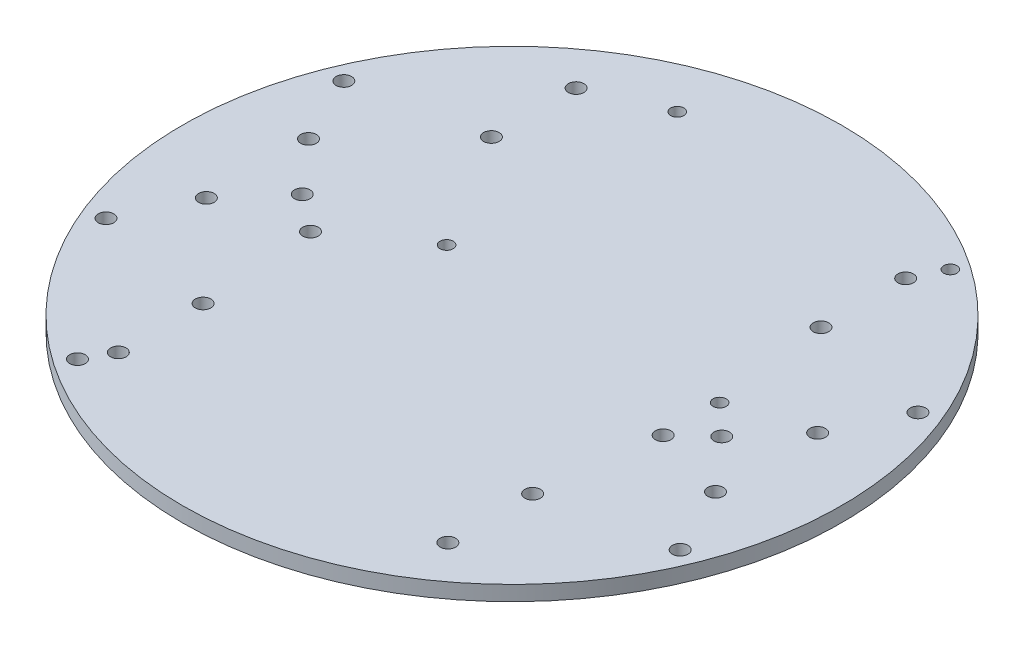
ISO-10303-21;
HEADER;
FILE_DESCRIPTION(('STEP AP214'),'2;1');
FILE_NAME('part.step','',(''),(''),'','','');
FILE_SCHEMA(('AUTOMOTIVE_DESIGN { 1 0 10303 214 1 1 1 1 }'));
ENDSEC;
DATA;
#1=APPLICATION_CONTEXT('core data for automotive mechanical design processes');
#2=APPLICATION_PROTOCOL_DEFINITION('international standard','automotive_design',2000,#1);
#3=PRODUCT_CONTEXT('',#1,'mechanical');
#4=PRODUCT('Part','Part','',(#3));
#5=PRODUCT_RELATED_PRODUCT_CATEGORY('part','',(#4));
#6=PRODUCT_DEFINITION_FORMATION('','',#4);
#7=PRODUCT_DEFINITION_CONTEXT('part definition',#1,'design');
#8=PRODUCT_DEFINITION('design','',#6,#7);
#9=PRODUCT_DEFINITION_SHAPE('','',#8);
#10=(LENGTH_UNIT() NAMED_UNIT(*) SI_UNIT(.MILLI.,.METRE.));
#11=(NAMED_UNIT(*) PLANE_ANGLE_UNIT() SI_UNIT($,.RADIAN.));
#12=(NAMED_UNIT(*) SI_UNIT($,.STERADIAN.) SOLID_ANGLE_UNIT());
#13=UNCERTAINTY_MEASURE_WITH_UNIT(LENGTH_MEASURE(1.E-05),#10,'distance_accuracy_value','');
#14=(GEOMETRIC_REPRESENTATION_CONTEXT(3) GLOBAL_UNCERTAINTY_ASSIGNED_CONTEXT((#13)) GLOBAL_UNIT_ASSIGNED_CONTEXT((#10,
#11,#12)) REPRESENTATION_CONTEXT('',''));
#15=CARTESIAN_POINT('',(0.,0.,0.));
#16=DIRECTION('',(0.,0.,1.));
#17=DIRECTION('',(1.,0.,0.));
#18=AXIS2_PLACEMENT_3D('',#15,#16,#17);
#19=CARTESIAN_POINT('',(0.,3.175,0.));
#20=DIRECTION('',(0.,1.,0.));
#21=DIRECTION('',(0.,0.,1.));
#22=AXIS2_PLACEMENT_3D('',#19,#20,#21);
#23=PLANE('',#22);
#24=CARTESIAN_POINT('',(-38.1,3.175,54.2));
#25=DIRECTION('',(0.,1.,0.));
#26=DIRECTION('',(0.,0.,1.));
#27=AXIS2_PLACEMENT_3D('',#24,#25,#26);
#28=CIRCLE('',#27,1.65);
#29=CARTESIAN_POINT('',(-38.1,3.175,55.85));
#30=VERTEX_POINT('',#29);
#31=EDGE_CURVE('E172',#30,#30,#28,.T.);
#32=ORIENTED_EDGE('',*,*,#31,.F.);
#33=EDGE_LOOP('',(#32));
#34=FACE_BOUND('',#33,.T.);
#35=CARTESIAN_POINT('',(-19.9,3.175,-6.));
#36=DIRECTION('',(0.,1.,0.));
#37=DIRECTION('',(0.,0.,1.));
#38=AXIS2_PLACEMENT_3D('',#35,#36,#37);
#39=CIRCLE('',#38,1.4);
#40=CARTESIAN_POINT('',(-19.9,3.175,-4.6));
#41=VERTEX_POINT('',#40);
#42=EDGE_CURVE('E161',#41,#41,#39,.T.);
#43=ORIENTED_EDGE('',*,*,#42,.F.);
#44=EDGE_LOOP('',(#43));
#45=FACE_BOUND('',#44,.T.);
#46=CARTESIAN_POINT('',(-19.9,3.175,-55.));
#47=DIRECTION('',(0.,1.,0.));
#48=DIRECTION('',(0.,0.,1.));
#49=AXIS2_PLACEMENT_3D('',#46,#47,#48);
#50=CIRCLE('',#49,1.4);
#51=CARTESIAN_POINT('',(-19.9,3.175,-53.6));
#52=VERTEX_POINT('',#51);
#53=EDGE_CURVE('E160',#52,#52,#50,.T.);
#54=ORIENTED_EDGE('',*,*,#53,.F.);
#55=EDGE_LOOP('',(#54));
#56=FACE_BOUND('',#55,.T.);
#57=CARTESIAN_POINT('',(38.1,3.175,-6.));
#58=DIRECTION('',(0.,1.,0.));
#59=DIRECTION('',(0.,0.,1.));
#60=AXIS2_PLACEMENT_3D('',#57,#58,#59);
#61=CIRCLE('',#60,1.4);
#62=CARTESIAN_POINT('',(38.1,3.175,-4.6));
#63=VERTEX_POINT('',#62);
#64=EDGE_CURVE('E154',#63,#63,#61,.T.);
#65=ORIENTED_EDGE('',*,*,#64,.F.);
#66=EDGE_LOOP('',(#65));
#67=FACE_BOUND('',#66,.T.);
#68=CARTESIAN_POINT('',(-36.8,3.175,6.));
#69=DIRECTION('',(0.,1.,0.));
#70=DIRECTION('',(0.,0.,1.));
#71=AXIS2_PLACEMENT_3D('',#68,#69,#70);
#72=CIRCLE('',#71,1.65);
#73=CARTESIAN_POINT('',(-36.8,3.175,7.65));
#74=VERTEX_POINT('',#73);
#75=EDGE_CURVE('E173',#74,#74,#72,.T.);
#76=ORIENTED_EDGE('',*,*,#75,.F.);
#77=EDGE_LOOP('',(#76));
#78=FACE_BOUND('',#77,.T.);
#79=CARTESIAN_POINT('',(38.1,3.175,6.));
#80=DIRECTION('',(0.,1.,0.));
#81=DIRECTION('',(0.,0.,1.));
#82=AXIS2_PLACEMENT_3D('',#79,#80,#81);
#83=CIRCLE('',#82,1.65);
#84=CARTESIAN_POINT('',(38.1,3.175,7.65));
#85=VERTEX_POINT('',#84);
#86=EDGE_CURVE('E184',#85,#85,#83,.T.);
#87=ORIENTED_EDGE('',*,*,#86,.F.);
#88=EDGE_LOOP('',(#87));
#89=FACE_BOUND('',#88,.T.);
#90=CARTESIAN_POINT('',(38.1,3.175,-55.));
#91=DIRECTION('',(0.,1.,0.));
#92=DIRECTION('',(0.,0.,1.));
#93=AXIS2_PLACEMENT_3D('',#90,#91,#92);
#94=CIRCLE('',#93,1.4);
#95=CARTESIAN_POINT('',(38.1,3.175,-53.6));
#96=VERTEX_POINT('',#95);
#97=EDGE_CURVE('E137',#96,#96,#94,.T.);
#98=ORIENTED_EDGE('',*,*,#97,.F.);
#99=EDGE_LOOP('',(#98));
#100=FACE_BOUND('',#99,.T.);
#101=CARTESIAN_POINT('',(-60.9760491457449,3.175,25.257106536096));
#102=DIRECTION('',(0.,1.,0.));
#103=DIRECTION('',(0.,0.,1.));
#104=AXIS2_PLACEMENT_3D('',#101,#102,#103);
#105=CIRCLE('',#104,1.65);
#106=CARTESIAN_POINT('',(-60.9760491457449,3.175,26.907106536096));
#107=VERTEX_POINT('',#106);
#108=EDGE_CURVE('E89',#107,#107,#105,.T.);
#109=ORIENTED_EDGE('',*,*,#108,.F.);
#110=EDGE_LOOP('',(#109));
#111=FACE_BOUND('',#110,.T.);
#112=CARTESIAN_POINT('',(35.,3.175,48.6217782649107));
#113=DIRECTION('',(0.,1.,0.));
#114=DIRECTION('',(0.,0.,-1.));
#115=AXIS2_PLACEMENT_3D('',#112,#113,#114);
#116=CIRCLE('',#115,1.65);
#117=CARTESIAN_POINT('',(35.,3.175,46.9717782649107));
#118=VERTEX_POINT('',#117);
#119=EDGE_CURVE('E112',#118,#118,#116,.T.);
#120=ORIENTED_EDGE('',*,*,#119,.F.);
#121=EDGE_LOOP('',(#120));
#122=FACE_BOUND('',#121,.T.);
#123=CARTESIAN_POINT('',(-35.,3.175,48.6217782649107));
#124=DIRECTION('',(0.,1.,0.));
#125=DIRECTION('',(0.,0.,1.));
#126=AXIS2_PLACEMENT_3D('',#123,#124,#125);
#127=CIRCLE('',#126,1.65);
#128=CARTESIAN_POINT('',(-35.,3.175,50.2717782649107));
#129=VERTEX_POINT('',#128);
#130=EDGE_CURVE('E113',#129,#129,#127,.T.);
#131=ORIENTED_EDGE('',*,*,#130,.F.);
#132=EDGE_LOOP('',(#131));
#133=FACE_BOUND('',#132,.T.);
#134=CARTESIAN_POINT('',(-60.9760491457449,3.175,-25.257106536096));
#135=DIRECTION('',(0.,1.,0.));
#136=DIRECTION('',(0.,0.,-1.));
#137=AXIS2_PLACEMENT_3D('',#134,#135,#136);
#138=CIRCLE('',#137,1.65);
#139=CARTESIAN_POINT('',(-60.9760491457449,3.175,-26.907106536096));
#140=VERTEX_POINT('',#139);
#141=EDGE_CURVE('E124',#140,#140,#138,.T.);
#142=ORIENTED_EDGE('',*,*,#141,.F.);
#143=EDGE_LOOP('',(#142));
#144=FACE_BOUND('',#143,.T.);
#145=CARTESIAN_POINT('',(35.,3.175,30.6217782649107));
#146=DIRECTION('',(0.,1.,0.));
#147=DIRECTION('',(0.,0.,-1.));
#148=AXIS2_PLACEMENT_3D('',#145,#146,#147);
#149=CIRCLE('',#148,1.65);
#150=CARTESIAN_POINT('',(35.,3.175,28.9717782649107));
#151=VERTEX_POINT('',#150);
#152=EDGE_CURVE('E88',#151,#151,#149,.T.);
#153=ORIENTED_EDGE('',*,*,#152,.F.);
#154=EDGE_LOOP('',(#153));
#155=FACE_BOUND('',#154,.T.);
#156=CARTESIAN_POINT('',(60.9760491457449,3.175,25.257106536096));
#157=DIRECTION('',(0.,1.,0.));
#158=DIRECTION('',(0.,0.,-1.));
#159=AXIS2_PLACEMENT_3D('',#156,#157,#158);
#160=CIRCLE('',#159,1.65);
#161=CARTESIAN_POINT('',(60.9760491457449,3.175,23.607106536096));
#162=VERTEX_POINT('',#161);
#163=EDGE_CURVE('E95',#162,#162,#160,.T.);
#164=ORIENTED_EDGE('',*,*,#163,.F.);
#165=EDGE_LOOP('',(#164));
#166=FACE_BOUND('',#165,.T.);
#167=CARTESIAN_POINT('',(35.,3.175,-30.6217782649107));
#168=DIRECTION('',(0.,1.,0.));
#169=DIRECTION('',(0.,0.,1.));
#170=AXIS2_PLACEMENT_3D('',#167,#168,#169);
#171=CIRCLE('',#170,1.65);
#172=CARTESIAN_POINT('',(35.,3.175,-28.9717782649107));
#173=VERTEX_POINT('',#172);
#174=EDGE_CURVE('E101',#173,#173,#171,.T.);
#175=ORIENTED_EDGE('',*,*,#174,.F.);
#176=EDGE_LOOP('',(#175));
#177=FACE_BOUND('',#176,.T.);
#178=CARTESIAN_POINT('',(60.9760491457449,3.175,-25.257106536096));
#179=DIRECTION('',(0.,1.,0.));
#180=DIRECTION('',(0.,0.,1.));
#181=AXIS2_PLACEMENT_3D('',#178,#179,#180);
#182=CIRCLE('',#181,1.65);
#183=CARTESIAN_POINT('',(60.9760491457449,3.175,-23.607106536096));
#184=VERTEX_POINT('',#183);
#185=EDGE_CURVE('E82',#184,#184,#182,.T.);
#186=ORIENTED_EDGE('',*,*,#185,.F.);
#187=EDGE_LOOP('',(#186));
#188=FACE_BOUND('',#187,.T.);
#189=CARTESIAN_POINT('',(-35.,3.175,30.6217782649107));
#190=DIRECTION('',(0.,1.,0.));
#191=DIRECTION('',(0.,0.,1.));
#192=AXIS2_PLACEMENT_3D('',#189,#190,#191);
#193=CIRCLE('',#192,1.65);
#194=CARTESIAN_POINT('',(-35.,3.175,32.2717782649107));
#195=VERTEX_POINT('',#194);
#196=EDGE_CURVE('E125',#195,#195,#193,.T.);
#197=ORIENTED_EDGE('',*,*,#196,.F.);
#198=EDGE_LOOP('',(#197));
#199=FACE_BOUND('',#198,.T.);
#200=CARTESIAN_POINT('',(-35.,3.175,-30.6217782649107));
#201=DIRECTION('',(0.,1.,0.));
#202=DIRECTION('',(0.,0.,-1.));
#203=AXIS2_PLACEMENT_3D('',#200,#201,#202);
#204=CIRCLE('',#203,1.65);
#205=CARTESIAN_POINT('',(-35.,3.175,-32.2717782649107));
#206=VERTEX_POINT('',#205);
#207=EDGE_CURVE('E143',#206,#206,#204,.T.);
#208=ORIENTED_EDGE('',*,*,#207,.F.);
#209=EDGE_LOOP('',(#208));
#210=FACE_BOUND('',#209,.T.);
#211=CARTESIAN_POINT('',(-35.,3.175,-48.6217782649107));
#212=DIRECTION('',(0.,1.,0.));
#213=DIRECTION('',(0.,0.,-1.));
#214=AXIS2_PLACEMENT_3D('',#211,#212,#213);
#215=CIRCLE('',#214,1.65);
#216=CARTESIAN_POINT('',(-35.,3.175,-50.2717782649107));
#217=VERTEX_POINT('',#216);
#218=EDGE_CURVE('E136',#217,#217,#215,.T.);
#219=ORIENTED_EDGE('',*,*,#218,.F.);
#220=EDGE_LOOP('',(#219));
#221=FACE_BOUND('',#220,.T.);
#222=CARTESIAN_POINT('',(35.,3.175,-48.6217782649107));
#223=DIRECTION('',(0.,1.,0.));
#224=DIRECTION('',(0.,0.,1.));
#225=AXIS2_PLACEMENT_3D('',#222,#223,#224);
#226=CIRCLE('',#225,1.65);
#227=CARTESIAN_POINT('',(35.,3.175,-46.9717782649107));
#228=VERTEX_POINT('',#227);
#229=EDGE_CURVE('E76',#228,#228,#226,.T.);
#230=ORIENTED_EDGE('',*,*,#229,.F.);
#231=EDGE_LOOP('',(#230));
#232=FACE_BOUND('',#231,.T.);
#233=CARTESIAN_POINT('',(-54.075,3.175,-10.85));
#234=DIRECTION('',(0.,1.,0.));
#235=DIRECTION('',(0.,0.,-1.));
#236=AXIS2_PLACEMENT_3D('',#233,#234,#235);
#237=CIRCLE('',#236,1.651);
#238=CARTESIAN_POINT('',(-54.075,3.175,-12.501));
#239=VERTEX_POINT('',#238);
#240=EDGE_CURVE('E64',#239,#239,#237,.T.);
#241=ORIENTED_EDGE('',*,*,#240,.F.);
#242=EDGE_LOOP('',(#241));
#243=FACE_BOUND('',#242,.T.);
#244=CARTESIAN_POINT('',(54.075,3.175,10.85));
#245=DIRECTION('',(0.,1.,0.));
#246=DIRECTION('',(0.,0.,1.));
#247=AXIS2_PLACEMENT_3D('',#244,#245,#246);
#248=CIRCLE('',#247,1.651);
#249=CARTESIAN_POINT('',(54.075,3.175,12.501));
#250=VERTEX_POINT('',#249);
#251=EDGE_CURVE('E52',#250,#250,#248,.T.);
#252=ORIENTED_EDGE('',*,*,#251,.F.);
#253=EDGE_LOOP('',(#252));
#254=FACE_BOUND('',#253,.T.);
#255=CARTESIAN_POINT('',(44.55,3.175,0.));
#256=DIRECTION('',(0.,1.,0.));
#257=DIRECTION('',(0.,0.,1.));
#258=AXIS2_PLACEMENT_3D('',#255,#256,#257);
#259=CIRCLE('',#258,1.651);
#260=CARTESIAN_POINT('',(44.55,3.175,1.65100000000002));
#261=VERTEX_POINT('',#260);
#262=EDGE_CURVE('E41',#261,#261,#259,.T.);
#263=ORIENTED_EDGE('',*,*,#262,.F.);
#264=EDGE_LOOP('',(#263));
#265=FACE_BOUND('',#264,.T.);
#266=CARTESIAN_POINT('',(0.,3.175,0.));
#267=DIRECTION('',(0.,1.,0.));
#268=DIRECTION('',(0.,0.,1.));
#269=AXIS2_PLACEMENT_3D('',#266,#267,#268);
#270=CIRCLE('',#269,70.);
#271=CARTESIAN_POINT('',(0.,3.175,70.));
#272=VERTEX_POINT('',#271);
#273=EDGE_CURVE('E10',#272,#272,#270,.T.);
#274=ORIENTED_EDGE('',*,*,#273,.T.);
#275=EDGE_LOOP('',(#274));
#276=FACE_BOUND('',#275,.T.);
#277=CARTESIAN_POINT('',(54.075,3.175,-10.85));
#278=DIRECTION('',(0.,1.,0.));
#279=DIRECTION('',(0.,0.,1.));
#280=AXIS2_PLACEMENT_3D('',#277,#278,#279);
#281=CIRCLE('',#280,1.651);
#282=CARTESIAN_POINT('',(54.075,3.175,-9.199));
#283=VERTEX_POINT('',#282);
#284=EDGE_CURVE('E46',#283,#283,#281,.T.);
#285=ORIENTED_EDGE('',*,*,#284,.F.);
#286=EDGE_LOOP('',(#285));
#287=FACE_BOUND('',#286,.T.);
#288=CARTESIAN_POINT('',(-54.075,3.175,10.85));
#289=DIRECTION('',(0.,1.,0.));
#290=DIRECTION('',(0.,0.,-1.));
#291=AXIS2_PLACEMENT_3D('',#288,#289,#290);
#292=CIRCLE('',#291,1.651);
#293=CARTESIAN_POINT('',(-54.075,3.175,9.19900000000002));
#294=VERTEX_POINT('',#293);
#295=EDGE_CURVE('E58',#294,#294,#292,.T.);
#296=ORIENTED_EDGE('',*,*,#295,.F.);
#297=EDGE_LOOP('',(#296));
#298=FACE_BOUND('',#297,.T.);
#299=CARTESIAN_POINT('',(-44.55,3.175,0.));
#300=DIRECTION('',(0.,1.,0.));
#301=DIRECTION('',(0.,0.,-1.));
#302=AXIS2_PLACEMENT_3D('',#299,#300,#301);
#303=CIRCLE('',#302,1.651);
#304=CARTESIAN_POINT('',(-44.55,3.175,-1.65099999999997));
#305=VERTEX_POINT('',#304);
#306=EDGE_CURVE('E70',#305,#305,#303,.T.);
#307=ORIENTED_EDGE('',*,*,#306,.F.);
#308=EDGE_LOOP('',(#307));
#309=FACE_BOUND('',#308,.T.);
#310=ADVANCED_FACE('F30',(#34,#45,#56,#67,#78,#89,#100,#111,#122,#133,#144,#155,#166,#177,#188,
#199,#210,#221,#232,#243,#254,#265,#276,#287,#298,#309),#23,.T.);
#311=CARTESIAN_POINT('',(0.,0.,0.));
#312=DIRECTION('',(0.,1.,0.));
#313=DIRECTION('',(0.,0.,1.));
#314=AXIS2_PLACEMENT_3D('',#311,#312,#313);
#315=PLANE('',#314);
#316=CARTESIAN_POINT('',(-38.1,0.,54.2));
#317=DIRECTION('',(0.,1.,0.));
#318=DIRECTION('',(0.,0.,1.));
#319=AXIS2_PLACEMENT_3D('',#316,#317,#318);
#320=CIRCLE('',#319,1.65);
#321=CARTESIAN_POINT('',(-38.1,0.,55.85));
#322=VERTEX_POINT('',#321);
#323=EDGE_CURVE('E169',#322,#322,#320,.T.);
#324=ORIENTED_EDGE('',*,*,#323,.T.);
#325=EDGE_LOOP('',(#324));
#326=FACE_BOUND('',#325,.T.);
#327=CARTESIAN_POINT('',(-19.9,0.,-6.));
#328=DIRECTION('',(0.,1.,0.));
#329=DIRECTION('',(0.,0.,1.));
#330=AXIS2_PLACEMENT_3D('',#327,#328,#329);
#331=CIRCLE('',#330,1.4);
#332=CARTESIAN_POINT('',(-19.9,0.,-4.6));
#333=VERTEX_POINT('',#332);
#334=EDGE_CURVE('E176',#333,#333,#331,.T.);
#335=ORIENTED_EDGE('',*,*,#334,.T.);
#336=EDGE_LOOP('',(#335));
#337=FACE_BOUND('',#336,.T.);
#338=CARTESIAN_POINT('',(-19.9,0.,-55.));
#339=DIRECTION('',(0.,1.,0.));
#340=DIRECTION('',(0.,0.,1.));
#341=AXIS2_PLACEMENT_3D('',#338,#339,#340);
#342=CIRCLE('',#341,1.4);
#343=CARTESIAN_POINT('',(-19.9,0.,-53.6));
#344=VERTEX_POINT('',#343);
#345=EDGE_CURVE('E157',#344,#344,#342,.T.);
#346=ORIENTED_EDGE('',*,*,#345,.T.);
#347=EDGE_LOOP('',(#346));
#348=FACE_BOUND('',#347,.T.);
#349=CARTESIAN_POINT('',(38.1,0.,-6.));
#350=DIRECTION('',(0.,1.,0.));
#351=DIRECTION('',(0.,0.,1.));
#352=AXIS2_PLACEMENT_3D('',#349,#350,#351);
#353=CIRCLE('',#352,1.4);
#354=CARTESIAN_POINT('',(38.1,0.,-4.6));
#355=VERTEX_POINT('',#354);
#356=EDGE_CURVE('E164',#355,#355,#353,.T.);
#357=ORIENTED_EDGE('',*,*,#356,.T.);
#358=EDGE_LOOP('',(#357));
#359=FACE_BOUND('',#358,.T.);
#360=CARTESIAN_POINT('',(-36.8,0.,6.));
#361=DIRECTION('',(0.,1.,0.));
#362=DIRECTION('',(0.,0.,1.));
#363=AXIS2_PLACEMENT_3D('',#360,#361,#362);
#364=CIRCLE('',#363,1.65);
#365=CARTESIAN_POINT('',(-36.8,0.,7.65));
#366=VERTEX_POINT('',#365);
#367=EDGE_CURVE('E187',#366,#366,#364,.T.);
#368=ORIENTED_EDGE('',*,*,#367,.T.);
#369=EDGE_LOOP('',(#368));
#370=FACE_BOUND('',#369,.T.);
#371=CARTESIAN_POINT('',(38.1,0.,6.));
#372=DIRECTION('',(0.,1.,0.));
#373=DIRECTION('',(0.,0.,1.));
#374=AXIS2_PLACEMENT_3D('',#371,#372,#373);
#375=CIRCLE('',#374,1.65);
#376=CARTESIAN_POINT('',(38.1,0.,7.65));
#377=VERTEX_POINT('',#376);
#378=EDGE_CURVE('E181',#377,#377,#375,.T.);
#379=ORIENTED_EDGE('',*,*,#378,.T.);
#380=EDGE_LOOP('',(#379));
#381=FACE_BOUND('',#380,.T.);
#382=CARTESIAN_POINT('',(38.1,0.,-55.));
#383=DIRECTION('',(0.,1.,0.));
#384=DIRECTION('',(0.,0.,1.));
#385=AXIS2_PLACEMENT_3D('',#382,#383,#384);
#386=CIRCLE('',#385,1.4);
#387=CARTESIAN_POINT('',(38.1,0.,-53.6));
#388=VERTEX_POINT('',#387);
#389=EDGE_CURVE('E151',#388,#388,#386,.T.);
#390=ORIENTED_EDGE('',*,*,#389,.T.);
#391=EDGE_LOOP('',(#390));
#392=FACE_BOUND('',#391,.T.);
#393=CARTESIAN_POINT('',(-60.9760491457449,0.,25.257106536096));
#394=DIRECTION('',(0.,1.,0.));
#395=DIRECTION('',(0.,0.,1.));
#396=AXIS2_PLACEMENT_3D('',#393,#394,#395);
#397=CIRCLE('',#396,1.65);
#398=CARTESIAN_POINT('',(-60.9760491457449,0.,26.907106536096));
#399=VERTEX_POINT('',#398);
#400=EDGE_CURVE('E116',#399,#399,#397,.T.);
#401=ORIENTED_EDGE('',*,*,#400,.T.);
#402=EDGE_LOOP('',(#401));
#403=FACE_BOUND('',#402,.T.);
#404=CARTESIAN_POINT('',(35.,0.,48.6217782649107));
#405=DIRECTION('',(0.,1.,0.));
#406=DIRECTION('',(0.,0.,-1.));
#407=AXIS2_PLACEMENT_3D('',#404,#405,#406);
#408=CIRCLE('',#407,1.65);
#409=CARTESIAN_POINT('',(35.,0.,46.9717782649107));
#410=VERTEX_POINT('',#409);
#411=EDGE_CURVE('E109',#410,#410,#408,.T.);
#412=ORIENTED_EDGE('',*,*,#411,.T.);
#413=EDGE_LOOP('',(#412));
#414=FACE_BOUND('',#413,.T.);
#415=CARTESIAN_POINT('',(-35.,0.,48.6217782649107));
#416=DIRECTION('',(0.,1.,0.));
#417=DIRECTION('',(0.,0.,1.));
#418=AXIS2_PLACEMENT_3D('',#415,#416,#417);
#419=CIRCLE('',#418,1.65);
#420=CARTESIAN_POINT('',(-35.,0.,50.2717782649107));
#421=VERTEX_POINT('',#420);
#422=EDGE_CURVE('E128',#421,#421,#419,.T.);
#423=ORIENTED_EDGE('',*,*,#422,.T.);
#424=EDGE_LOOP('',(#423));
#425=FACE_BOUND('',#424,.T.);
#426=CARTESIAN_POINT('',(-60.9760491457449,0.,-25.257106536096));
#427=DIRECTION('',(0.,1.,0.));
#428=DIRECTION('',(0.,0.,-1.));
#429=AXIS2_PLACEMENT_3D('',#426,#427,#428);
#430=CIRCLE('',#429,1.65);
#431=CARTESIAN_POINT('',(-60.9760491457449,0.,-26.907106536096));
#432=VERTEX_POINT('',#431);
#433=EDGE_CURVE('E121',#432,#432,#430,.T.);
#434=ORIENTED_EDGE('',*,*,#433,.T.);
#435=EDGE_LOOP('',(#434));
#436=FACE_BOUND('',#435,.T.);
#437=CARTESIAN_POINT('',(35.,0.,30.6217782649107));
#438=DIRECTION('',(0.,1.,0.));
#439=DIRECTION('',(0.,0.,-1.));
#440=AXIS2_PLACEMENT_3D('',#437,#438,#439);
#441=CIRCLE('',#440,1.65);
#442=CARTESIAN_POINT('',(35.,0.,28.9717782649107));
#443=VERTEX_POINT('',#442);
#444=EDGE_CURVE('E85',#443,#443,#441,.T.);
#445=ORIENTED_EDGE('',*,*,#444,.T.);
#446=EDGE_LOOP('',(#445));
#447=FACE_BOUND('',#446,.T.);
#448=CARTESIAN_POINT('',(60.9760491457449,0.,25.257106536096));
#449=DIRECTION('',(0.,1.,0.));
#450=DIRECTION('',(0.,0.,-1.));
#451=AXIS2_PLACEMENT_3D('',#448,#449,#450);
#452=CIRCLE('',#451,1.65);
#453=CARTESIAN_POINT('',(60.9760491457449,0.,23.607106536096));
#454=VERTEX_POINT('',#453);
#455=EDGE_CURVE('E92',#454,#454,#452,.T.);
#456=ORIENTED_EDGE('',*,*,#455,.T.);
#457=EDGE_LOOP('',(#456));
#458=FACE_BOUND('',#457,.T.);
#459=CARTESIAN_POINT('',(35.,0.,-30.6217782649107));
#460=DIRECTION('',(0.,1.,0.));
#461=DIRECTION('',(0.,0.,1.));
#462=AXIS2_PLACEMENT_3D('',#459,#460,#461);
#463=CIRCLE('',#462,1.65);
#464=CARTESIAN_POINT('',(35.,0.,-28.9717782649107));
#465=VERTEX_POINT('',#464);
#466=EDGE_CURVE('E98',#465,#465,#463,.T.);
#467=ORIENTED_EDGE('',*,*,#466,.T.);
#468=EDGE_LOOP('',(#467));
#469=FACE_BOUND('',#468,.T.);
#470=CARTESIAN_POINT('',(60.9760491457449,0.,-25.257106536096));
#471=DIRECTION('',(0.,1.,0.));
#472=DIRECTION('',(0.,0.,1.));
#473=AXIS2_PLACEMENT_3D('',#470,#471,#472);
#474=CIRCLE('',#473,1.65);
#475=CARTESIAN_POINT('',(60.9760491457449,0.,-23.607106536096));
#476=VERTEX_POINT('',#475);
#477=EDGE_CURVE('E104',#476,#476,#474,.T.);
#478=ORIENTED_EDGE('',*,*,#477,.T.);
#479=EDGE_LOOP('',(#478));
#480=FACE_BOUND('',#479,.T.);
#481=CARTESIAN_POINT('',(-35.,0.,30.6217782649107));
#482=DIRECTION('',(0.,1.,0.));
#483=DIRECTION('',(0.,0.,1.));
#484=AXIS2_PLACEMENT_3D('',#481,#482,#483);
#485=CIRCLE('',#484,1.65);
#486=CARTESIAN_POINT('',(-35.,0.,32.2717782649107));
#487=VERTEX_POINT('',#486);
#488=EDGE_CURVE('E146',#487,#487,#485,.T.);
#489=ORIENTED_EDGE('',*,*,#488,.T.);
#490=EDGE_LOOP('',(#489));
#491=FACE_BOUND('',#490,.T.);
#492=CARTESIAN_POINT('',(-35.,0.,-30.6217782649107));
#493=DIRECTION('',(0.,1.,0.));
#494=DIRECTION('',(0.,0.,-1.));
#495=AXIS2_PLACEMENT_3D('',#492,#493,#494);
#496=CIRCLE('',#495,1.65);
#497=CARTESIAN_POINT('',(-35.,0.,-32.2717782649107));
#498=VERTEX_POINT('',#497);
#499=EDGE_CURVE('E140',#498,#498,#496,.T.);
#500=ORIENTED_EDGE('',*,*,#499,.T.);
#501=EDGE_LOOP('',(#500));
#502=FACE_BOUND('',#501,.T.);
#503=CARTESIAN_POINT('',(-35.,0.,-48.6217782649107));
#504=DIRECTION('',(0.,1.,0.));
#505=DIRECTION('',(0.,0.,-1.));
#506=AXIS2_PLACEMENT_3D('',#503,#504,#505);
#507=CIRCLE('',#506,1.65);
#508=CARTESIAN_POINT('',(-35.,0.,-50.2717782649107));
#509=VERTEX_POINT('',#508);
#510=EDGE_CURVE('E133',#509,#509,#507,.T.);
#511=ORIENTED_EDGE('',*,*,#510,.T.);
#512=EDGE_LOOP('',(#511));
#513=FACE_BOUND('',#512,.T.);
#514=CARTESIAN_POINT('',(35.,0.,-48.6217782649107));
#515=DIRECTION('',(0.,1.,0.));
#516=DIRECTION('',(0.,0.,1.));
#517=AXIS2_PLACEMENT_3D('',#514,#515,#516);
#518=CIRCLE('',#517,1.65);
#519=CARTESIAN_POINT('',(35.,0.,-46.9717782649107));
#520=VERTEX_POINT('',#519);
#521=EDGE_CURVE('E79',#520,#520,#518,.T.);
#522=ORIENTED_EDGE('',*,*,#521,.T.);
#523=EDGE_LOOP('',(#522));
#524=FACE_BOUND('',#523,.T.);
#525=CARTESIAN_POINT('',(0.,0.,0.));
#526=DIRECTION('',(0.,1.,0.));
#527=DIRECTION('',(0.,0.,1.));
#528=AXIS2_PLACEMENT_3D('',#525,#526,#527);
#529=CIRCLE('',#528,70.);
#530=CARTESIAN_POINT('',(0.,0.,70.));
#531=VERTEX_POINT('',#530);
#532=EDGE_CURVE('E34',#531,#531,#529,.T.);
#533=ORIENTED_EDGE('',*,*,#532,.F.);
#534=EDGE_LOOP('',(#533));
#535=FACE_BOUND('',#534,.T.);
#536=CARTESIAN_POINT('',(44.55,0.,0.));
#537=DIRECTION('',(0.,1.,0.));
#538=DIRECTION('',(0.,0.,1.));
#539=AXIS2_PLACEMENT_3D('',#536,#537,#538);
#540=CIRCLE('',#539,1.651);
#541=CARTESIAN_POINT('',(44.55,0.,1.65100000000002));
#542=VERTEX_POINT('',#541);
#543=EDGE_CURVE('E43',#542,#542,#540,.T.);
#544=ORIENTED_EDGE('',*,*,#543,.T.);
#545=EDGE_LOOP('',(#544));
#546=FACE_BOUND('',#545,.T.);
#547=CARTESIAN_POINT('',(54.075,0.,-10.85));
#548=DIRECTION('',(0.,1.,0.));
#549=DIRECTION('',(0.,0.,1.));
#550=AXIS2_PLACEMENT_3D('',#547,#548,#549);
#551=CIRCLE('',#550,1.651);
#552=CARTESIAN_POINT('',(54.075,0.,-9.199));
#553=VERTEX_POINT('',#552);
#554=EDGE_CURVE('E49',#553,#553,#551,.T.);
#555=ORIENTED_EDGE('',*,*,#554,.T.);
#556=EDGE_LOOP('',(#555));
#557=FACE_BOUND('',#556,.T.);
#558=CARTESIAN_POINT('',(54.075,0.,10.85));
#559=DIRECTION('',(0.,1.,0.));
#560=DIRECTION('',(0.,0.,1.));
#561=AXIS2_PLACEMENT_3D('',#558,#559,#560);
#562=CIRCLE('',#561,1.651);
#563=CARTESIAN_POINT('',(54.075,0.,12.501));
#564=VERTEX_POINT('',#563);
#565=EDGE_CURVE('E55',#564,#564,#562,.T.);
#566=ORIENTED_EDGE('',*,*,#565,.T.);
#567=EDGE_LOOP('',(#566));
#568=FACE_BOUND('',#567,.T.);
#569=CARTESIAN_POINT('',(-54.075,0.,10.85));
#570=DIRECTION('',(0.,1.,0.));
#571=DIRECTION('',(0.,0.,-1.));
#572=AXIS2_PLACEMENT_3D('',#569,#570,#571);
#573=CIRCLE('',#572,1.651);
#574=CARTESIAN_POINT('',(-54.075,0.,9.19900000000002));
#575=VERTEX_POINT('',#574);
#576=EDGE_CURVE('E61',#575,#575,#573,.T.);
#577=ORIENTED_EDGE('',*,*,#576,.T.);
#578=EDGE_LOOP('',(#577));
#579=FACE_BOUND('',#578,.T.);
#580=CARTESIAN_POINT('',(-54.075,0.,-10.85));
#581=DIRECTION('',(0.,1.,0.));
#582=DIRECTION('',(0.,0.,-1.));
#583=AXIS2_PLACEMENT_3D('',#580,#581,#582);
#584=CIRCLE('',#583,1.651);
#585=CARTESIAN_POINT('',(-54.075,0.,-12.501));
#586=VERTEX_POINT('',#585);
#587=EDGE_CURVE('E67',#586,#586,#584,.T.);
#588=ORIENTED_EDGE('',*,*,#587,.T.);
#589=EDGE_LOOP('',(#588));
#590=FACE_BOUND('',#589,.T.);
#591=CARTESIAN_POINT('',(-44.55,0.,0.));
#592=DIRECTION('',(0.,1.,0.));
#593=DIRECTION('',(0.,0.,-1.));
#594=AXIS2_PLACEMENT_3D('',#591,#592,#593);
#595=CIRCLE('',#594,1.651);
#596=CARTESIAN_POINT('',(-44.55,0.,-1.65099999999997));
#597=VERTEX_POINT('',#596);
#598=EDGE_CURVE('E73',#597,#597,#595,.T.);
#599=ORIENTED_EDGE('',*,*,#598,.T.);
#600=EDGE_LOOP('',(#599));
#601=FACE_BOUND('',#600,.T.);
#602=ADVANCED_FACE('F198',(#326,#337,#348,#359,#370,#381,#392,#403,#414,#425,#436,#447,#458,
#469,#480,#491,#502,#513,#524,#535,#546,#557,#568,#579,#590,#601),#315,.F.);
#603=CARTESIAN_POINT('',(0.,3.175,0.));
#604=DIRECTION('',(0.,-1.,0.));
#605=DIRECTION('',(0.,0.,-1.));
#606=AXIS2_PLACEMENT_3D('',#603,#604,#605);
#607=CYLINDRICAL_SURFACE('',#606,70.);
#608=ORIENTED_EDGE('',*,*,#273,.F.);
#609=EDGE_LOOP('',(#608));
#610=FACE_BOUND('',#609,.T.);
#611=ORIENTED_EDGE('',*,*,#532,.T.);
#612=EDGE_LOOP('',(#611));
#613=FACE_BOUND('',#612,.T.);
#614=ADVANCED_FACE('F32',(#610,#613),#607,.T.);
#615=CARTESIAN_POINT('',(44.55,3.175,0.));
#616=DIRECTION('',(0.,-1.,0.));
#617=DIRECTION('',(0.,0.,-1.));
#618=AXIS2_PLACEMENT_3D('',#615,#616,#617);
#619=CYLINDRICAL_SURFACE('',#618,1.651);
#620=ORIENTED_EDGE('',*,*,#262,.T.);
#621=EDGE_LOOP('',(#620));
#622=FACE_BOUND('',#621,.T.);
#623=ORIENTED_EDGE('',*,*,#543,.F.);
#624=EDGE_LOOP('',(#623));
#625=FACE_BOUND('',#624,.T.);
#626=ADVANCED_FACE('F254',(#622,#625),#619,.F.);
#627=CARTESIAN_POINT('',(54.075,3.175,-10.85));
#628=DIRECTION('',(0.,-1.,0.));
#629=DIRECTION('',(0.,0.,-1.));
#630=AXIS2_PLACEMENT_3D('',#627,#628,#629);
#631=CYLINDRICAL_SURFACE('',#630,1.651);
#632=ORIENTED_EDGE('',*,*,#284,.T.);
#633=EDGE_LOOP('',(#632));
#634=FACE_BOUND('',#633,.T.);
#635=ORIENTED_EDGE('',*,*,#554,.F.);
#636=EDGE_LOOP('',(#635));
#637=FACE_BOUND('',#636,.T.);
#638=ADVANCED_FACE('F260',(#634,#637),#631,.F.);
#639=CARTESIAN_POINT('',(54.075,3.175,10.85));
#640=DIRECTION('',(0.,-1.,0.));
#641=DIRECTION('',(0.,0.,-1.));
#642=AXIS2_PLACEMENT_3D('',#639,#640,#641);
#643=CYLINDRICAL_SURFACE('',#642,1.651);
#644=ORIENTED_EDGE('',*,*,#251,.T.);
#645=EDGE_LOOP('',(#644));
#646=FACE_BOUND('',#645,.T.);
#647=ORIENTED_EDGE('',*,*,#565,.F.);
#648=EDGE_LOOP('',(#647));
#649=FACE_BOUND('',#648,.T.);
#650=ADVANCED_FACE('F264',(#646,#649),#643,.F.);
#651=CARTESIAN_POINT('',(-54.075,3.175,10.85));
#652=DIRECTION('',(0.,-1.,0.));
#653=DIRECTION('',(0.,0.,-1.));
#654=AXIS2_PLACEMENT_3D('',#651,#652,#653);
#655=CYLINDRICAL_SURFACE('',#654,1.651);
#656=ORIENTED_EDGE('',*,*,#295,.T.);
#657=EDGE_LOOP('',(#656));
#658=FACE_BOUND('',#657,.T.);
#659=ORIENTED_EDGE('',*,*,#576,.F.);
#660=EDGE_LOOP('',(#659));
#661=FACE_BOUND('',#660,.T.);
#662=ADVANCED_FACE('F268',(#658,#661),#655,.F.);
#663=CARTESIAN_POINT('',(-54.075,3.175,-10.85));
#664=DIRECTION('',(0.,-1.,0.));
#665=DIRECTION('',(0.,0.,-1.));
#666=AXIS2_PLACEMENT_3D('',#663,#664,#665);
#667=CYLINDRICAL_SURFACE('',#666,1.651);
#668=ORIENTED_EDGE('',*,*,#240,.T.);
#669=EDGE_LOOP('',(#668));
#670=FACE_BOUND('',#669,.T.);
#671=ORIENTED_EDGE('',*,*,#587,.F.);
#672=EDGE_LOOP('',(#671));
#673=FACE_BOUND('',#672,.T.);
#674=ADVANCED_FACE('F245',(#670,#673),#667,.F.);
#675=CARTESIAN_POINT('',(-44.55,3.175,0.));
#676=DIRECTION('',(0.,-1.,0.));
#677=DIRECTION('',(0.,0.,-1.));
#678=AXIS2_PLACEMENT_3D('',#675,#676,#677);
#679=CYLINDRICAL_SURFACE('',#678,1.651);
#680=ORIENTED_EDGE('',*,*,#306,.T.);
#681=EDGE_LOOP('',(#680));
#682=FACE_BOUND('',#681,.T.);
#683=ORIENTED_EDGE('',*,*,#598,.F.);
#684=EDGE_LOOP('',(#683));
#685=FACE_BOUND('',#684,.T.);
#686=ADVANCED_FACE('F241',(#682,#685),#679,.F.);
#687=CARTESIAN_POINT('',(35.,3.175,-48.6217782649107));
#688=DIRECTION('',(0.,-1.,0.));
#689=DIRECTION('',(0.,0.,-1.));
#690=AXIS2_PLACEMENT_3D('',#687,#688,#689);
#691=CYLINDRICAL_SURFACE('',#690,1.65);
#692=ORIENTED_EDGE('',*,*,#229,.T.);
#693=EDGE_LOOP('',(#692));
#694=FACE_BOUND('',#693,.T.);
#695=ORIENTED_EDGE('',*,*,#521,.F.);
#696=EDGE_LOOP('',(#695));
#697=FACE_BOUND('',#696,.T.);
#698=ADVANCED_FACE('F244',(#694,#697),#691,.F.);
#699=CARTESIAN_POINT('',(-35.,3.175,-48.6217782649107));
#700=DIRECTION('',(0.,-1.,0.));
#701=DIRECTION('',(0.,0.,-1.));
#702=AXIS2_PLACEMENT_3D('',#699,#700,#701);
#703=CYLINDRICAL_SURFACE('',#702,1.65);
#704=ORIENTED_EDGE('',*,*,#218,.T.);
#705=EDGE_LOOP('',(#704));
#706=FACE_BOUND('',#705,.T.);
#707=ORIENTED_EDGE('',*,*,#510,.F.);
#708=EDGE_LOOP('',(#707));
#709=FACE_BOUND('',#708,.T.);
#710=ADVANCED_FACE('F278',(#706,#709),#703,.F.);
#711=CARTESIAN_POINT('',(-35.,3.175,-30.6217782649107));
#712=DIRECTION('',(0.,-1.,0.));
#713=DIRECTION('',(0.,0.,-1.));
#714=AXIS2_PLACEMENT_3D('',#711,#712,#713);
#715=CYLINDRICAL_SURFACE('',#714,1.65);
#716=ORIENTED_EDGE('',*,*,#207,.T.);
#717=EDGE_LOOP('',(#716));
#718=FACE_BOUND('',#717,.T.);
#719=ORIENTED_EDGE('',*,*,#499,.F.);
#720=EDGE_LOOP('',(#719));
#721=FACE_BOUND('',#720,.T.);
#722=ADVANCED_FACE('F316',(#718,#721),#715,.F.);
#723=CARTESIAN_POINT('',(-35.,3.175,30.6217782649107));
#724=DIRECTION('',(0.,-1.,0.));
#725=DIRECTION('',(0.,0.,-1.));
#726=AXIS2_PLACEMENT_3D('',#723,#724,#725);
#727=CYLINDRICAL_SURFACE('',#726,1.65);
#728=ORIENTED_EDGE('',*,*,#196,.T.);
#729=EDGE_LOOP('',(#728));
#730=FACE_BOUND('',#729,.T.);
#731=ORIENTED_EDGE('',*,*,#488,.F.);
#732=EDGE_LOOP('',(#731));
#733=FACE_BOUND('',#732,.T.);
#734=ADVANCED_FACE('F296',(#730,#733),#727,.F.);
#735=CARTESIAN_POINT('',(60.9760491457449,3.175,-25.257106536096));
#736=DIRECTION('',(0.,-1.,0.));
#737=DIRECTION('',(0.,0.,-1.));
#738=AXIS2_PLACEMENT_3D('',#735,#736,#737);
#739=CYLINDRICAL_SURFACE('',#738,1.65);
#740=ORIENTED_EDGE('',*,*,#185,.T.);
#741=EDGE_LOOP('',(#740));
#742=FACE_BOUND('',#741,.T.);
#743=ORIENTED_EDGE('',*,*,#477,.F.);
#744=EDGE_LOOP('',(#743));
#745=FACE_BOUND('',#744,.T.);
#746=ADVANCED_FACE('F292',(#742,#745),#739,.F.);
#747=CARTESIAN_POINT('',(35.,3.175,-30.6217782649107));
#748=DIRECTION('',(0.,-1.,0.));
#749=DIRECTION('',(0.,0.,-1.));
#750=AXIS2_PLACEMENT_3D('',#747,#748,#749);
#751=CYLINDRICAL_SURFACE('',#750,1.65);
#752=ORIENTED_EDGE('',*,*,#174,.T.);
#753=EDGE_LOOP('',(#752));
#754=FACE_BOUND('',#753,.T.);
#755=ORIENTED_EDGE('',*,*,#466,.F.);
#756=EDGE_LOOP('',(#755));
#757=FACE_BOUND('',#756,.T.);
#758=ADVANCED_FACE('F288',(#754,#757),#751,.F.);
#759=CARTESIAN_POINT('',(60.9760491457449,3.175,25.257106536096));
#760=DIRECTION('',(0.,-1.,0.));
#761=DIRECTION('',(0.,0.,-1.));
#762=AXIS2_PLACEMENT_3D('',#759,#760,#761);
#763=CYLINDRICAL_SURFACE('',#762,1.65);
#764=ORIENTED_EDGE('',*,*,#163,.T.);
#765=EDGE_LOOP('',(#764));
#766=FACE_BOUND('',#765,.T.);
#767=ORIENTED_EDGE('',*,*,#455,.F.);
#768=EDGE_LOOP('',(#767));
#769=FACE_BOUND('',#768,.T.);
#770=ADVANCED_FACE('F284',(#766,#769),#763,.F.);
#771=CARTESIAN_POINT('',(35.,3.175,30.6217782649107));
#772=DIRECTION('',(0.,-1.,0.));
#773=DIRECTION('',(0.,0.,-1.));
#774=AXIS2_PLACEMENT_3D('',#771,#772,#773);
#775=CYLINDRICAL_SURFACE('',#774,1.65);
#776=ORIENTED_EDGE('',*,*,#152,.T.);
#777=EDGE_LOOP('',(#776));
#778=FACE_BOUND('',#777,.T.);
#779=ORIENTED_EDGE('',*,*,#444,.F.);
#780=EDGE_LOOP('',(#779));
#781=FACE_BOUND('',#780,.T.);
#782=ADVANCED_FACE('F280',(#778,#781),#775,.F.);
#783=CARTESIAN_POINT('',(-60.9760491457449,3.175,-25.257106536096));
#784=DIRECTION('',(0.,-1.,0.));
#785=DIRECTION('',(0.,0.,-1.));
#786=AXIS2_PLACEMENT_3D('',#783,#784,#785);
#787=CYLINDRICAL_SURFACE('',#786,1.65);
#788=ORIENTED_EDGE('',*,*,#141,.T.);
#789=EDGE_LOOP('',(#788));
#790=FACE_BOUND('',#789,.T.);
#791=ORIENTED_EDGE('',*,*,#433,.F.);
#792=EDGE_LOOP('',(#791));
#793=FACE_BOUND('',#792,.T.);
#794=ADVANCED_FACE('F283',(#790,#793),#787,.F.);
#795=CARTESIAN_POINT('',(-35.,3.175,48.6217782649107));
#796=DIRECTION('',(0.,-1.,0.));
#797=DIRECTION('',(0.,0.,-1.));
#798=AXIS2_PLACEMENT_3D('',#795,#796,#797);
#799=CYLINDRICAL_SURFACE('',#798,1.65);
#800=ORIENTED_EDGE('',*,*,#130,.T.);
#801=EDGE_LOOP('',(#800));
#802=FACE_BOUND('',#801,.T.);
#803=ORIENTED_EDGE('',*,*,#422,.F.);
#804=EDGE_LOOP('',(#803));
#805=FACE_BOUND('',#804,.T.);
#806=ADVANCED_FACE('F302',(#802,#805),#799,.F.);
#807=CARTESIAN_POINT('',(35.,3.175,48.6217782649107));
#808=DIRECTION('',(0.,-1.,0.));
#809=DIRECTION('',(0.,0.,-1.));
#810=AXIS2_PLACEMENT_3D('',#807,#808,#809);
#811=CYLINDRICAL_SURFACE('',#810,1.65);
#812=ORIENTED_EDGE('',*,*,#119,.T.);
#813=EDGE_LOOP('',(#812));
#814=FACE_BOUND('',#813,.T.);
#815=ORIENTED_EDGE('',*,*,#411,.F.);
#816=EDGE_LOOP('',(#815));
#817=FACE_BOUND('',#816,.T.);
#818=ADVANCED_FACE('F298',(#814,#817),#811,.F.);
#819=CARTESIAN_POINT('',(-60.9760491457449,3.175,25.257106536096));
#820=DIRECTION('',(0.,-1.,0.));
#821=DIRECTION('',(0.,0.,-1.));
#822=AXIS2_PLACEMENT_3D('',#819,#820,#821);
#823=CYLINDRICAL_SURFACE('',#822,1.65);
#824=ORIENTED_EDGE('',*,*,#108,.T.);
#825=EDGE_LOOP('',(#824));
#826=FACE_BOUND('',#825,.T.);
#827=ORIENTED_EDGE('',*,*,#400,.F.);
#828=EDGE_LOOP('',(#827));
#829=FACE_BOUND('',#828,.T.);
#830=ADVANCED_FACE('F301',(#826,#829),#823,.F.);
#831=CARTESIAN_POINT('',(38.1,3.175,-55.));
#832=DIRECTION('',(0.,-1.,0.));
#833=DIRECTION('',(0.,0.,-1.));
#834=AXIS2_PLACEMENT_3D('',#831,#832,#833);
#835=CYLINDRICAL_SURFACE('',#834,1.4);
#836=ORIENTED_EDGE('',*,*,#97,.T.);
#837=EDGE_LOOP('',(#836));
#838=FACE_BOUND('',#837,.T.);
#839=ORIENTED_EDGE('',*,*,#389,.F.);
#840=EDGE_LOOP('',(#839));
#841=FACE_BOUND('',#840,.T.);
#842=ADVANCED_FACE('F306',(#838,#841),#835,.F.);
#843=CARTESIAN_POINT('',(38.1,3.175,6.));
#844=DIRECTION('',(0.,-1.,0.));
#845=DIRECTION('',(0.,0.,-1.));
#846=AXIS2_PLACEMENT_3D('',#843,#844,#845);
#847=CYLINDRICAL_SURFACE('',#846,1.65);
#848=ORIENTED_EDGE('',*,*,#86,.T.);
#849=EDGE_LOOP('',(#848));
#850=FACE_BOUND('',#849,.T.);
#851=ORIENTED_EDGE('',*,*,#378,.F.);
#852=EDGE_LOOP('',(#851));
#853=FACE_BOUND('',#852,.T.);
#854=ADVANCED_FACE('F326',(#850,#853),#847,.F.);
#855=CARTESIAN_POINT('',(-36.8,3.175,6.));
#856=DIRECTION('',(0.,-1.,0.));
#857=DIRECTION('',(0.,0.,-1.));
#858=AXIS2_PLACEMENT_3D('',#855,#856,#857);
#859=CYLINDRICAL_SURFACE('',#858,1.65);
#860=ORIENTED_EDGE('',*,*,#75,.T.);
#861=EDGE_LOOP('',(#860));
#862=FACE_BOUND('',#861,.T.);
#863=ORIENTED_EDGE('',*,*,#367,.F.);
#864=EDGE_LOOP('',(#863));
#865=FACE_BOUND('',#864,.T.);
#866=ADVANCED_FACE('F193',(#862,#865),#859,.F.);
#867=CARTESIAN_POINT('',(38.1,3.175,-6.));
#868=DIRECTION('',(0.,-1.,0.));
#869=DIRECTION('',(0.,0.,-1.));
#870=AXIS2_PLACEMENT_3D('',#867,#868,#869);
#871=CYLINDRICAL_SURFACE('',#870,1.4);
#872=ORIENTED_EDGE('',*,*,#64,.T.);
#873=EDGE_LOOP('',(#872));
#874=FACE_BOUND('',#873,.T.);
#875=ORIENTED_EDGE('',*,*,#356,.F.);
#876=EDGE_LOOP('',(#875));
#877=FACE_BOUND('',#876,.T.);
#878=ADVANCED_FACE('F332',(#874,#877),#871,.F.);
#879=CARTESIAN_POINT('',(-19.9,3.175,-55.));
#880=DIRECTION('',(0.,-1.,0.));
#881=DIRECTION('',(0.,0.,-1.));
#882=AXIS2_PLACEMENT_3D('',#879,#880,#881);
#883=CYLINDRICAL_SURFACE('',#882,1.4);
#884=ORIENTED_EDGE('',*,*,#53,.T.);
#885=EDGE_LOOP('',(#884));
#886=FACE_BOUND('',#885,.T.);
#887=ORIENTED_EDGE('',*,*,#345,.F.);
#888=EDGE_LOOP('',(#887));
#889=FACE_BOUND('',#888,.T.);
#890=ADVANCED_FACE('F328',(#886,#889),#883,.F.);
#891=CARTESIAN_POINT('',(-19.9,3.175,-6.));
#892=DIRECTION('',(0.,-1.,0.));
#893=DIRECTION('',(0.,0.,-1.));
#894=AXIS2_PLACEMENT_3D('',#891,#892,#893);
#895=CYLINDRICAL_SURFACE('',#894,1.4);
#896=ORIENTED_EDGE('',*,*,#42,.T.);
#897=EDGE_LOOP('',(#896));
#898=FACE_BOUND('',#897,.T.);
#899=ORIENTED_EDGE('',*,*,#334,.F.);
#900=EDGE_LOOP('',(#899));
#901=FACE_BOUND('',#900,.T.);
#902=ADVANCED_FACE('F331',(#898,#901),#895,.F.);
#903=CARTESIAN_POINT('',(-38.1,3.175,54.2));
#904=DIRECTION('',(0.,-1.,0.));
#905=DIRECTION('',(0.,0.,-1.));
#906=AXIS2_PLACEMENT_3D('',#903,#904,#905);
#907=CYLINDRICAL_SURFACE('',#906,1.65);
#908=ORIENTED_EDGE('',*,*,#31,.T.);
#909=EDGE_LOOP('',(#908));
#910=FACE_BOUND('',#909,.T.);
#911=ORIENTED_EDGE('',*,*,#323,.F.);
#912=EDGE_LOOP('',(#911));
#913=FACE_BOUND('',#912,.T.);
#914=ADVANCED_FACE('F337',(#910,#913),#907,.F.);
#915=CLOSED_SHELL('',(#310,#602,#614,#626,#638,#650,#662,#674,#686,#698,#710,#722,#734,#746,
#758,#770,#782,#794,#806,#818,#830,#842,#854,#866,#878,#890,#902,#914));
#916=MANIFOLD_SOLID_BREP('B2',#915);
#917=ADVANCED_BREP_SHAPE_REPRESENTATION('',(#18,#916),#14);
#918=SHAPE_DEFINITION_REPRESENTATION(#9,#917);
ENDSEC;
END-ISO-10303-21;
